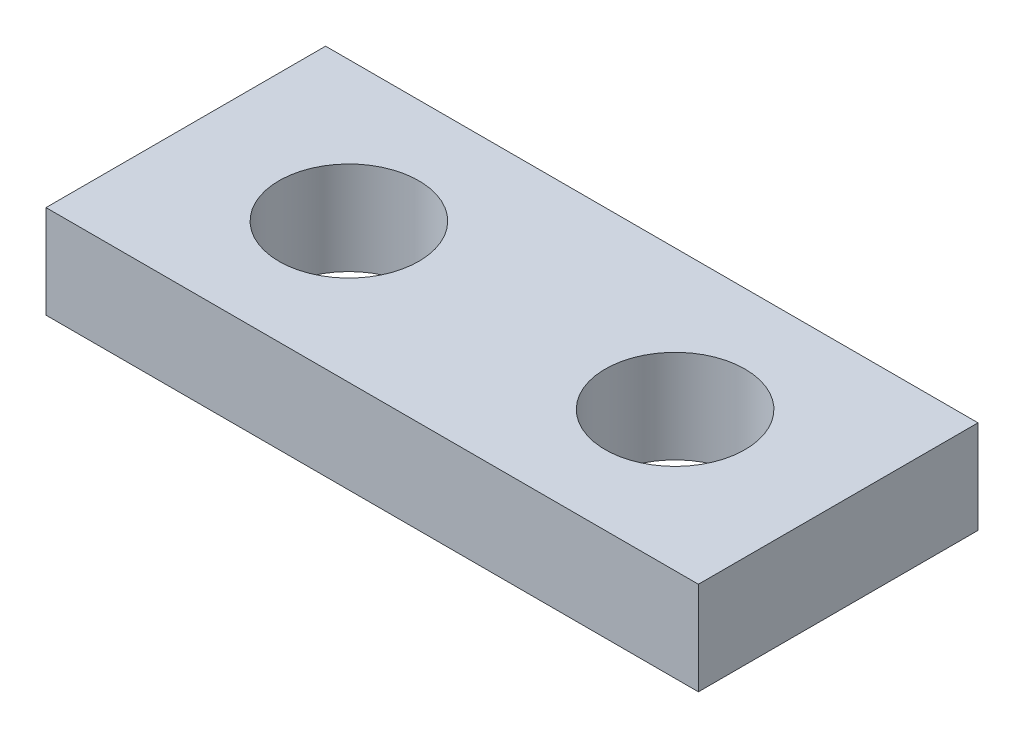
ISO-10303-21;
HEADER;
FILE_DESCRIPTION(('STEP AP214'),'2;1');
FILE_NAME('part.step','',(''),(''),'','','');
FILE_SCHEMA(('AUTOMOTIVE_DESIGN { 1 0 10303 214 1 1 1 1 }'));
ENDSEC;
DATA;
#1=APPLICATION_CONTEXT('core data for automotive mechanical design processes');
#2=APPLICATION_PROTOCOL_DEFINITION('international standard','automotive_design',2000,#1);
#3=PRODUCT_CONTEXT('',#1,'mechanical');
#4=PRODUCT('Part','Part','',(#3));
#5=PRODUCT_RELATED_PRODUCT_CATEGORY('part','',(#4));
#6=PRODUCT_DEFINITION_FORMATION('','',#4);
#7=PRODUCT_DEFINITION_CONTEXT('part definition',#1,'design');
#8=PRODUCT_DEFINITION('design','',#6,#7);
#9=PRODUCT_DEFINITION_SHAPE('','',#8);
#10=(LENGTH_UNIT() NAMED_UNIT(*) SI_UNIT(.MILLI.,.METRE.));
#11=(NAMED_UNIT(*) PLANE_ANGLE_UNIT() SI_UNIT($,.RADIAN.));
#12=(NAMED_UNIT(*) SI_UNIT($,.STERADIAN.) SOLID_ANGLE_UNIT());
#13=UNCERTAINTY_MEASURE_WITH_UNIT(LENGTH_MEASURE(1.E-05),#10,'distance_accuracy_value','');
#14=(GEOMETRIC_REPRESENTATION_CONTEXT(3) GLOBAL_UNCERTAINTY_ASSIGNED_CONTEXT((#13)) GLOBAL_UNIT_ASSIGNED_CONTEXT((#10,
#11,#12)) REPRESENTATION_CONTEXT('',''));
#15=CARTESIAN_POINT('',(0.,0.,0.));
#16=DIRECTION('',(0.,0.,1.));
#17=DIRECTION('',(1.,0.,0.));
#18=AXIS2_PLACEMENT_3D('',#15,#16,#17);
#19=CARTESIAN_POINT('',(0.,2.,0.));
#20=DIRECTION('',(0.,-1.,0.));
#21=DIRECTION('',(0.,0.,-1.));
#22=AXIS2_PLACEMENT_3D('',#19,#20,#21);
#23=PLANE('',#22);
#24=CARTESIAN_POINT('',(3.5,2.,-3.));
#25=DIRECTION('',(0.,1.,0.));
#26=DIRECTION('',(0.,0.,1.));
#27=AXIS2_PLACEMENT_3D('',#24,#25,#26);
#28=CIRCLE('',#27,1.5);
#29=CARTESIAN_POINT('',(3.5,2.,-1.5));
#30=VERTEX_POINT('',#29);
#31=EDGE_CURVE('E100',#30,#30,#28,.T.);
#32=ORIENTED_EDGE('',*,*,#31,.F.);
#33=EDGE_LOOP('',(#32));
#34=FACE_BOUND('',#33,.T.);
#35=DIRECTION('',(0.,0.,1.));
#36=VECTOR('',#35,1.);
#37=CARTESIAN_POINT('',(0.,2.,0.));
#38=LINE('',#37,#36);
#39=CARTESIAN_POINT('',(0.,2.,-6.));
#40=VERTEX_POINT('',#39);
#41=CARTESIAN_POINT('',(0.,2.,0.));
#42=VERTEX_POINT('',#41);
#43=EDGE_CURVE('E85',#40,#42,#38,.T.);
#44=ORIENTED_EDGE('',*,*,#43,.T.);
#45=DIRECTION('',(1.,0.,0.));
#46=VECTOR('',#45,1.);
#47=CARTESIAN_POINT('',(0.,2.,0.));
#48=LINE('',#47,#46);
#49=CARTESIAN_POINT('',(14.,2.,0.));
#50=VERTEX_POINT('',#49);
#51=EDGE_CURVE('E80',#42,#50,#48,.T.);
#52=ORIENTED_EDGE('',*,*,#51,.T.);
#53=DIRECTION('',(0.,0.,-1.));
#54=VECTOR('',#53,1.);
#55=CARTESIAN_POINT('',(14.,2.,0.));
#56=LINE('',#55,#54);
#57=CARTESIAN_POINT('',(14.,2.,-6.));
#58=VERTEX_POINT('',#57);
#59=EDGE_CURVE('E83',#50,#58,#56,.T.);
#60=ORIENTED_EDGE('',*,*,#59,.T.);
#61=DIRECTION('',(-1.,0.,0.));
#62=VECTOR('',#61,1.);
#63=CARTESIAN_POINT('',(0.,2.,-6.));
#64=LINE('',#63,#62);
#65=EDGE_CURVE('E50',#58,#40,#64,.T.);
#66=ORIENTED_EDGE('',*,*,#65,.T.);
#67=EDGE_LOOP('',(#44,#52,#60,#66));
#68=FACE_BOUND('',#67,.T.);
#69=CARTESIAN_POINT('',(10.5,2.,-3.));
#70=DIRECTION('',(0.,1.,0.));
#71=DIRECTION('',(0.,0.,-1.));
#72=AXIS2_PLACEMENT_3D('',#69,#70,#71);
#73=CIRCLE('',#72,1.5);
#74=CARTESIAN_POINT('',(10.5,2.,-4.5));
#75=VERTEX_POINT('',#74);
#76=EDGE_CURVE('E115',#75,#75,#73,.T.);
#77=ORIENTED_EDGE('',*,*,#76,.F.);
#78=EDGE_LOOP('',(#77));
#79=FACE_BOUND('',#78,.T.);
#80=ADVANCED_FACE('F33',(#34,#68,#79),#23,.F.);
#81=CARTESIAN_POINT('',(0.,0.,0.));
#82=DIRECTION('',(0.,-1.,0.));
#83=DIRECTION('',(0.,0.,-1.));
#84=AXIS2_PLACEMENT_3D('',#81,#82,#83);
#85=PLANE('',#84);
#86=CARTESIAN_POINT('',(3.5,0.,-3.));
#87=DIRECTION('',(0.,1.,0.));
#88=DIRECTION('',(0.,0.,1.));
#89=AXIS2_PLACEMENT_3D('',#86,#87,#88);
#90=CIRCLE('',#89,1.5);
#91=CARTESIAN_POINT('',(3.5,0.,-1.5));
#92=VERTEX_POINT('',#91);
#93=EDGE_CURVE('E112',#92,#92,#90,.T.);
#94=ORIENTED_EDGE('',*,*,#93,.T.);
#95=EDGE_LOOP('',(#94));
#96=FACE_BOUND('',#95,.T.);
#97=DIRECTION('',(0.,0.,1.));
#98=VECTOR('',#97,1.);
#99=CARTESIAN_POINT('',(0.,0.,0.));
#100=LINE('',#99,#98);
#101=CARTESIAN_POINT('',(0.,0.,-6.));
#102=VERTEX_POINT('',#101);
#103=CARTESIAN_POINT('',(0.,0.,0.));
#104=VERTEX_POINT('',#103);
#105=EDGE_CURVE('E97',#102,#104,#100,.T.);
#106=ORIENTED_EDGE('',*,*,#105,.F.);
#107=DIRECTION('',(-1.,0.,0.));
#108=VECTOR('',#107,1.);
#109=CARTESIAN_POINT('',(0.,0.,-6.));
#110=LINE('',#109,#108);
#111=CARTESIAN_POINT('',(14.,0.,-6.));
#112=VERTEX_POINT('',#111);
#113=EDGE_CURVE('E73',#112,#102,#110,.T.);
#114=ORIENTED_EDGE('',*,*,#113,.F.);
#115=DIRECTION('',(0.,0.,-1.));
#116=VECTOR('',#115,1.);
#117=CARTESIAN_POINT('',(14.,0.,0.));
#118=LINE('',#117,#116);
#119=CARTESIAN_POINT('',(14.,0.,0.));
#120=VERTEX_POINT('',#119);
#121=EDGE_CURVE('E67',#120,#112,#118,.T.);
#122=ORIENTED_EDGE('',*,*,#121,.F.);
#123=DIRECTION('',(1.,0.,0.));
#124=VECTOR('',#123,1.);
#125=CARTESIAN_POINT('',(0.,0.,0.));
#126=LINE('',#125,#124);
#127=EDGE_CURVE('E89',#104,#120,#126,.T.);
#128=ORIENTED_EDGE('',*,*,#127,.F.);
#129=EDGE_LOOP('',(#106,#114,#122,#128));
#130=FACE_BOUND('',#129,.T.);
#131=CARTESIAN_POINT('',(10.5,0.,-3.));
#132=DIRECTION('',(0.,1.,0.));
#133=DIRECTION('',(0.,0.,-1.));
#134=AXIS2_PLACEMENT_3D('',#131,#132,#133);
#135=CIRCLE('',#134,1.5);
#136=CARTESIAN_POINT('',(10.5,0.,-4.5));
#137=VERTEX_POINT('',#136);
#138=EDGE_CURVE('E118',#137,#137,#135,.T.);
#139=ORIENTED_EDGE('',*,*,#138,.T.);
#140=EDGE_LOOP('',(#139));
#141=FACE_BOUND('',#140,.T.);
#142=ADVANCED_FACE('F108',(#96,#130,#141),#85,.T.);
#143=CARTESIAN_POINT('',(0.,2.,0.));
#144=DIRECTION('',(1.,0.,0.));
#145=DIRECTION('',(0.,0.,-1.));
#146=AXIS2_PLACEMENT_3D('',#143,#144,#145);
#147=PLANE('',#146);
#148=ORIENTED_EDGE('',*,*,#105,.T.);
#149=DIRECTION('',(0.,-1.,0.));
#150=VECTOR('',#149,1.);
#151=CARTESIAN_POINT('',(0.,2.,0.));
#152=LINE('',#151,#150);
#153=EDGE_CURVE('E11',#42,#104,#152,.T.);
#154=ORIENTED_EDGE('',*,*,#153,.F.);
#155=ORIENTED_EDGE('',*,*,#43,.F.);
#156=DIRECTION('',(0.,-1.,0.));
#157=VECTOR('',#156,1.);
#158=CARTESIAN_POINT('',(0.,2.,-6.));
#159=LINE('',#158,#157);
#160=EDGE_CURVE('E93',#40,#102,#159,.T.);
#161=ORIENTED_EDGE('',*,*,#160,.T.);
#162=EDGE_LOOP('',(#148,#154,#155,#161));
#163=FACE_BOUND('',#162,.T.);
#164=ADVANCED_FACE('F35',(#163),#147,.F.);
#165=CARTESIAN_POINT('',(0.,2.,0.));
#166=DIRECTION('',(0.,0.,-1.));
#167=DIRECTION('',(-1.,0.,0.));
#168=AXIS2_PLACEMENT_3D('',#165,#166,#167);
#169=PLANE('',#168);
#170=ORIENTED_EDGE('',*,*,#127,.T.);
#171=DIRECTION('',(0.,-1.,0.));
#172=VECTOR('',#171,1.);
#173=CARTESIAN_POINT('',(14.,2.,0.));
#174=LINE('',#173,#172);
#175=EDGE_CURVE('E42',#50,#120,#174,.T.);
#176=ORIENTED_EDGE('',*,*,#175,.F.);
#177=ORIENTED_EDGE('',*,*,#51,.F.);
#178=ORIENTED_EDGE('',*,*,#153,.T.);
#179=EDGE_LOOP('',(#170,#176,#177,#178));
#180=FACE_BOUND('',#179,.T.);
#181=ADVANCED_FACE('F88',(#180),#169,.F.);
#182=CARTESIAN_POINT('',(14.,2.,0.));
#183=DIRECTION('',(-1.,0.,0.));
#184=DIRECTION('',(0.,0.,1.));
#185=AXIS2_PLACEMENT_3D('',#182,#183,#184);
#186=PLANE('',#185);
#187=ORIENTED_EDGE('',*,*,#121,.T.);
#188=DIRECTION('',(0.,-1.,0.));
#189=VECTOR('',#188,1.);
#190=CARTESIAN_POINT('',(14.,2.,-6.));
#191=LINE('',#190,#189);
#192=EDGE_CURVE('E90',#58,#112,#191,.T.);
#193=ORIENTED_EDGE('',*,*,#192,.F.);
#194=ORIENTED_EDGE('',*,*,#59,.F.);
#195=ORIENTED_EDGE('',*,*,#175,.T.);
#196=EDGE_LOOP('',(#187,#193,#194,#195));
#197=FACE_BOUND('',#196,.T.);
#198=ADVANCED_FACE('F91',(#197),#186,.F.);
#199=CARTESIAN_POINT('',(0.,2.,-6.));
#200=DIRECTION('',(0.,0.,1.));
#201=DIRECTION('',(1.,0.,0.));
#202=AXIS2_PLACEMENT_3D('',#199,#200,#201);
#203=PLANE('',#202);
#204=ORIENTED_EDGE('',*,*,#113,.T.);
#205=ORIENTED_EDGE('',*,*,#160,.F.);
#206=ORIENTED_EDGE('',*,*,#65,.F.);
#207=ORIENTED_EDGE('',*,*,#192,.T.);
#208=EDGE_LOOP('',(#204,#205,#206,#207));
#209=FACE_BOUND('',#208,.T.);
#210=ADVANCED_FACE('F105',(#209),#203,.F.);
#211=CARTESIAN_POINT('',(3.5,2.,-3.));
#212=DIRECTION('',(0.,-1.,0.));
#213=DIRECTION('',(0.,0.,-1.));
#214=AXIS2_PLACEMENT_3D('',#211,#212,#213);
#215=CYLINDRICAL_SURFACE('',#214,1.5);
#216=ORIENTED_EDGE('',*,*,#31,.T.);
#217=EDGE_LOOP('',(#216));
#218=FACE_BOUND('',#217,.T.);
#219=ORIENTED_EDGE('',*,*,#93,.F.);
#220=EDGE_LOOP('',(#219));
#221=FACE_BOUND('',#220,.T.);
#222=ADVANCED_FACE('F136',(#218,#221),#215,.F.);
#223=CARTESIAN_POINT('',(10.5,2.,-3.));
#224=DIRECTION('',(0.,-1.,0.));
#225=DIRECTION('',(0.,0.,-1.));
#226=AXIS2_PLACEMENT_3D('',#223,#224,#225);
#227=CYLINDRICAL_SURFACE('',#226,1.5);
#228=ORIENTED_EDGE('',*,*,#76,.T.);
#229=EDGE_LOOP('',(#228));
#230=FACE_BOUND('',#229,.T.);
#231=ORIENTED_EDGE('',*,*,#138,.F.);
#232=EDGE_LOOP('',(#231));
#233=FACE_BOUND('',#232,.T.);
#234=ADVANCED_FACE('F124',(#230,#233),#227,.F.);
#235=CLOSED_SHELL('',(#80,#142,#164,#181,#198,#210,#222,#234));
#236=MANIFOLD_SOLID_BREP('B2',#235);
#237=ADVANCED_BREP_SHAPE_REPRESENTATION('',(#18,#236),#14);
#238=SHAPE_DEFINITION_REPRESENTATION(#9,#237);
ENDSEC;
END-ISO-10303-21;
